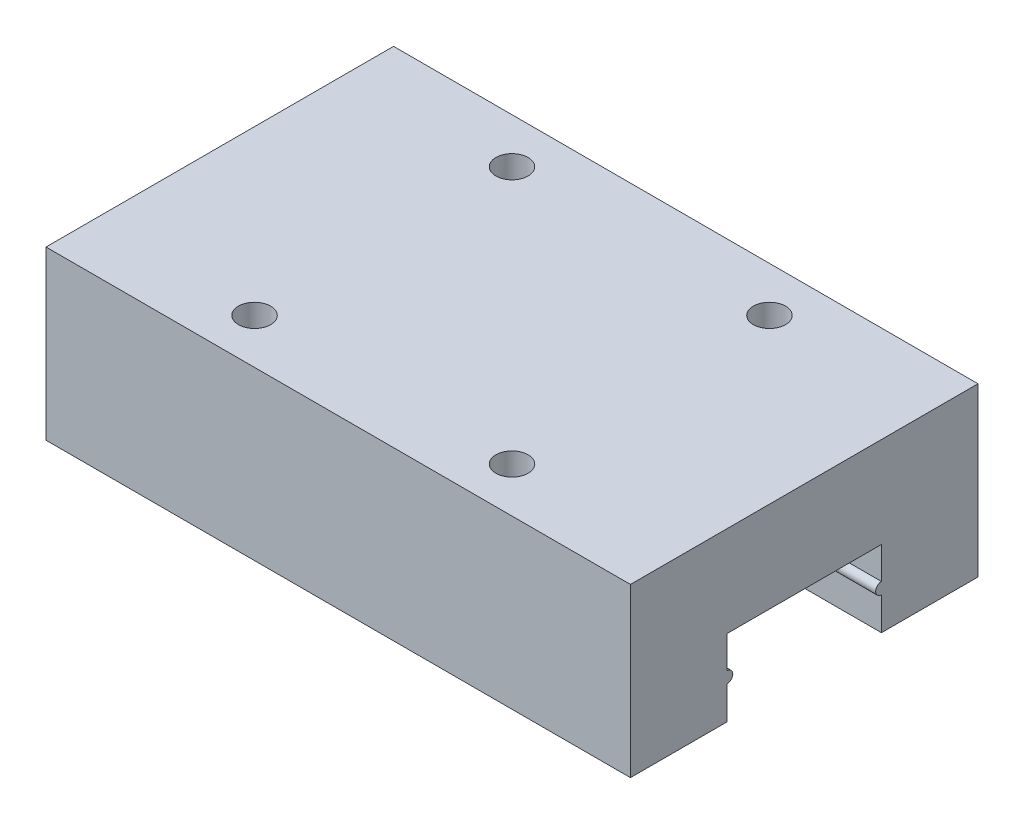
ISO-10303-21;
HEADER;
FILE_DESCRIPTION(('STEP AP214'),'2;1');
FILE_NAME('part.step','',(''),(''),'','','');
FILE_SCHEMA(('AUTOMOTIVE_DESIGN { 1 0 10303 214 1 1 1 1 }'));
ENDSEC;
DATA;
#1=APPLICATION_CONTEXT('core data for automotive mechanical design processes');
#2=APPLICATION_PROTOCOL_DEFINITION('international standard','automotive_design',2000,#1);
#3=PRODUCT_CONTEXT('',#1,'mechanical');
#4=PRODUCT('Part','Part','',(#3));
#5=PRODUCT_RELATED_PRODUCT_CATEGORY('part','',(#4));
#6=PRODUCT_DEFINITION_FORMATION('','',#4);
#7=PRODUCT_DEFINITION_CONTEXT('part definition',#1,'design');
#8=PRODUCT_DEFINITION('design','',#6,#7);
#9=PRODUCT_DEFINITION_SHAPE('','',#8);
#10=(LENGTH_UNIT() NAMED_UNIT(*) SI_UNIT(.MILLI.,.METRE.));
#11=(NAMED_UNIT(*) PLANE_ANGLE_UNIT() SI_UNIT($,.RADIAN.));
#12=(NAMED_UNIT(*) SI_UNIT($,.STERADIAN.) SOLID_ANGLE_UNIT());
#13=UNCERTAINTY_MEASURE_WITH_UNIT(LENGTH_MEASURE(1.E-05),#10,'distance_accuracy_value','');
#14=(GEOMETRIC_REPRESENTATION_CONTEXT(3) GLOBAL_UNCERTAINTY_ASSIGNED_CONTEXT((#13)) GLOBAL_UNIT_ASSIGNED_CONTEXT((#10,
#11,#12)) REPRESENTATION_CONTEXT('',''));
#15=CARTESIAN_POINT('',(0.,0.,0.));
#16=DIRECTION('',(0.,0.,1.));
#17=DIRECTION('',(1.,0.,0.));
#18=AXIS2_PLACEMENT_3D('',#15,#16,#17);
#19=CARTESIAN_POINT('',(32.7,13.,-3.5));
#20=DIRECTION('',(0.,1.,0.));
#21=DIRECTION('',(0.,0.,1.));
#22=AXIS2_PLACEMENT_3D('',#19,#20,#21);
#23=CYLINDRICAL_SURFACE('',#22,1.25);
#24=CARTESIAN_POINT('',(32.7,9.5,-3.5));
#25=DIRECTION('',(0.,1.,0.));
#26=DIRECTION('',(0.,0.,1.));
#27=AXIS2_PLACEMENT_3D('',#24,#25,#26);
#28=CIRCLE('',#27,1.25);
#29=CARTESIAN_POINT('',(32.7,9.5,-2.25));
#30=VERTEX_POINT('',#29);
#31=EDGE_CURVE('E13',#30,#30,#28,.T.);
#32=ORIENTED_EDGE('',*,*,#31,.F.);
#33=EDGE_LOOP('',(#32));
#34=FACE_BOUND('',#33,.T.);
#35=CARTESIAN_POINT('',(32.7,13.,-3.5));
#36=DIRECTION('',(0.,1.,0.));
#37=DIRECTION('',(0.,0.,1.));
#38=AXIS2_PLACEMENT_3D('',#35,#36,#37);
#39=CIRCLE('',#38,1.25);
#40=CARTESIAN_POINT('',(32.7,13.,-2.25));
#41=VERTEX_POINT('',#40);
#42=EDGE_CURVE('E70',#41,#41,#39,.T.);
#43=ORIENTED_EDGE('',*,*,#42,.T.);
#44=EDGE_LOOP('',(#43));
#45=FACE_BOUND('',#44,.T.);
#46=ADVANCED_FACE('F62',(#34,#45),#23,.F.);
#47=CARTESIAN_POINT('',(32.7,9.5,-3.5));
#48=DIRECTION('',(0.,1.,0.));
#49=DIRECTION('',(0.,0.,1.));
#50=AXIS2_PLACEMENT_3D('',#47,#48,#49);
#51=CONICAL_SURFACE('',#50,1.25,1.02974425867665);
#52=CARTESIAN_POINT('',(32.7,8.74892422621555,-3.5));
#53=VERTEX_POINT('',#52);
#54=VERTEX_LOOP('',#53);
#55=FACE_BOUND('',#54,.T.);
#56=ORIENTED_EDGE('',*,*,#31,.T.);
#57=EDGE_LOOP('',(#56));
#58=FACE_BOUND('',#57,.T.);
#59=ADVANCED_FACE('F332',(#55,#58),#51,.F.);
#60=CARTESIAN_POINT('',(12.7,13.,-3.5));
#61=DIRECTION('',(0.,1.,0.));
#62=DIRECTION('',(0.,0.,1.));
#63=AXIS2_PLACEMENT_3D('',#60,#61,#62);
#64=CYLINDRICAL_SURFACE('',#63,1.25);
#65=CARTESIAN_POINT('',(12.7,9.5,-3.5));
#66=DIRECTION('',(0.,1.,0.));
#67=DIRECTION('',(0.,0.,1.));
#68=AXIS2_PLACEMENT_3D('',#65,#66,#67);
#69=CIRCLE('',#68,1.25);
#70=CARTESIAN_POINT('',(12.7,9.5,-2.25));
#71=VERTEX_POINT('',#70);
#72=EDGE_CURVE('E303',#71,#71,#69,.T.);
#73=ORIENTED_EDGE('',*,*,#72,.F.);
#74=EDGE_LOOP('',(#73));
#75=FACE_BOUND('',#74,.T.);
#76=CARTESIAN_POINT('',(12.7,13.,-3.5));
#77=DIRECTION('',(0.,1.,0.));
#78=DIRECTION('',(0.,0.,1.));
#79=AXIS2_PLACEMENT_3D('',#76,#77,#78);
#80=CIRCLE('',#79,1.25);
#81=CARTESIAN_POINT('',(12.7,13.,-2.25));
#82=VERTEX_POINT('',#81);
#83=EDGE_CURVE('E299',#82,#82,#80,.T.);
#84=ORIENTED_EDGE('',*,*,#83,.T.);
#85=EDGE_LOOP('',(#84));
#86=FACE_BOUND('',#85,.T.);
#87=ADVANCED_FACE('F337',(#75,#86),#64,.F.);
#88=CARTESIAN_POINT('',(12.7,9.5,-3.5));
#89=DIRECTION('',(0.,1.,0.));
#90=DIRECTION('',(0.,0.,1.));
#91=AXIS2_PLACEMENT_3D('',#88,#89,#90);
#92=CONICAL_SURFACE('',#91,1.25,1.02974425867665);
#93=CARTESIAN_POINT('',(12.7,8.74892422621555,-3.5));
#94=VERTEX_POINT('',#93);
#95=VERTEX_LOOP('',#94);
#96=FACE_BOUND('',#95,.T.);
#97=ORIENTED_EDGE('',*,*,#72,.T.);
#98=EDGE_LOOP('',(#97));
#99=FACE_BOUND('',#98,.T.);
#100=ADVANCED_FACE('F343',(#96,#99),#92,.F.);
#101=CARTESIAN_POINT('',(45.4,0.,-19.5));
#102=DIRECTION('',(0.,0.,-1.));
#103=DIRECTION('',(-1.,0.,0.));
#104=AXIS2_PLACEMENT_3D('',#101,#102,#103);
#105=PLANE('',#104);
#106=DIRECTION('',(0.,-1.,0.));
#107=VECTOR('',#106,1.);
#108=CARTESIAN_POINT('',(0.,0.,-19.5));
#109=LINE('',#108,#107);
#110=CARTESIAN_POINT('',(0.,5.94145413786868,-19.5));
#111=VERTEX_POINT('',#110);
#112=CARTESIAN_POINT('',(0.,3.45,-19.5));
#113=VERTEX_POINT('',#112);
#114=EDGE_CURVE('E182',#111,#113,#109,.T.);
#115=ORIENTED_EDGE('',*,*,#114,.T.);
#116=DIRECTION('',(-1.,0.,0.));
#117=VECTOR('',#116,1.);
#118=CARTESIAN_POINT('',(45.4,3.45,-19.5));
#119=LINE('',#118,#117);
#120=CARTESIAN_POINT('',(45.4,3.45,-19.5));
#121=VERTEX_POINT('',#120);
#122=EDGE_CURVE('E295',#121,#113,#119,.T.);
#123=ORIENTED_EDGE('',*,*,#122,.F.);
#124=DIRECTION('',(0.,-1.,0.));
#125=VECTOR('',#124,1.);
#126=CARTESIAN_POINT('',(45.4,0.,-19.5));
#127=LINE('',#126,#125);
#128=CARTESIAN_POINT('',(45.4,5.94145413786868,-19.5));
#129=VERTEX_POINT('',#128);
#130=EDGE_CURVE('E183',#129,#121,#127,.T.);
#131=ORIENTED_EDGE('',*,*,#130,.F.);
#132=DIRECTION('',(-1.,0.,0.));
#133=VECTOR('',#132,1.);
#134=CARTESIAN_POINT('',(45.4,5.94145413786868,-19.5));
#135=LINE('',#134,#133);
#136=EDGE_CURVE('E220',#129,#111,#135,.T.);
#137=ORIENTED_EDGE('',*,*,#136,.T.);
#138=EDGE_LOOP('',(#115,#123,#131,#137));
#139=FACE_BOUND('',#138,.T.);
#140=ADVANCED_FACE('F349',(#139),#105,.F.);
#141=CARTESIAN_POINT('',(45.4,3.,-19.5));
#142=DIRECTION('',(-1.,0.,0.));
#143=DIRECTION('',(0.,0.,1.));
#144=AXIS2_PLACEMENT_3D('',#141,#142,#143);
#145=CYLINDRICAL_SURFACE('',#144,0.45);
#146=CARTESIAN_POINT('',(0.,3.,-19.5));
#147=DIRECTION('',(1.,0.,0.));
#148=DIRECTION('',(0.,0.,-1.));
#149=AXIS2_PLACEMENT_3D('',#146,#147,#148);
#150=CIRCLE('',#149,0.45);
#151=CARTESIAN_POINT('',(0.,2.55,-19.5));
#152=VERTEX_POINT('',#151);
#153=EDGE_CURVE('E224',#113,#152,#150,.T.);
#154=ORIENTED_EDGE('',*,*,#153,.T.);
#155=DIRECTION('',(-1.,0.,0.));
#156=VECTOR('',#155,1.);
#157=CARTESIAN_POINT('',(45.4,2.55,-19.5));
#158=LINE('',#157,#156);
#159=CARTESIAN_POINT('',(45.4,2.55,-19.5));
#160=VERTEX_POINT('',#159);
#161=EDGE_CURVE('E291',#160,#152,#158,.T.);
#162=ORIENTED_EDGE('',*,*,#161,.F.);
#163=CARTESIAN_POINT('',(45.4,3.,-19.5));
#164=DIRECTION('',(1.,0.,0.));
#165=DIRECTION('',(0.,0.,-1.));
#166=AXIS2_PLACEMENT_3D('',#163,#164,#165);
#167=CIRCLE('',#166,0.45);
#168=EDGE_CURVE('E187',#121,#160,#167,.T.);
#169=ORIENTED_EDGE('',*,*,#168,.F.);
#170=ORIENTED_EDGE('',*,*,#122,.T.);
#171=EDGE_LOOP('',(#154,#162,#169,#170));
#172=FACE_BOUND('',#171,.T.);
#173=ADVANCED_FACE('F350',(#172),#145,.T.);
#174=CARTESIAN_POINT('',(0.,0.,-19.5));
#175=VERTEX_POINT('',#174);
#176=EDGE_CURVE('E225',#152,#175,#109,.T.);
#177=ORIENTED_EDGE('',*,*,#176,.T.);
#178=DIRECTION('',(-1.,0.,0.));
#179=VECTOR('',#178,1.);
#180=CARTESIAN_POINT('',(45.4,0.,-19.5));
#181=LINE('',#180,#179);
#182=CARTESIAN_POINT('',(45.4,0.,-19.5));
#183=VERTEX_POINT('',#182);
#184=EDGE_CURVE('E287',#183,#175,#181,.T.);
#185=ORIENTED_EDGE('',*,*,#184,.F.);
#186=EDGE_CURVE('E189',#160,#183,#127,.T.);
#187=ORIENTED_EDGE('',*,*,#186,.F.);
#188=ORIENTED_EDGE('',*,*,#161,.T.);
#189=EDGE_LOOP('',(#177,#185,#187,#188));
#190=FACE_BOUND('',#189,.T.);
#191=ADVANCED_FACE('F353',(#190),#105,.F.);
#192=CARTESIAN_POINT('',(45.4,0.,0.));
#193=DIRECTION('',(0.,1.,0.));
#194=DIRECTION('',(0.,0.,1.));
#195=AXIS2_PLACEMENT_3D('',#192,#193,#194);
#196=PLANE('',#195);
#197=DIRECTION('',(0.,0.,-1.));
#198=VECTOR('',#197,1.);
#199=CARTESIAN_POINT('',(0.,0.,0.));
#200=LINE('',#199,#198);
#201=CARTESIAN_POINT('',(0.,0.,-27.));
#202=VERTEX_POINT('',#201);
#203=EDGE_CURVE('E228',#175,#202,#200,.T.);
#204=ORIENTED_EDGE('',*,*,#203,.T.);
#205=DIRECTION('',(-1.,0.,0.));
#206=VECTOR('',#205,1.);
#207=CARTESIAN_POINT('',(45.4,0.,-27.));
#208=LINE('',#207,#206);
#209=CARTESIAN_POINT('',(45.4,0.,-27.));
#210=VERTEX_POINT('',#209);
#211=EDGE_CURVE('E283',#210,#202,#208,.T.);
#212=ORIENTED_EDGE('',*,*,#211,.F.);
#213=DIRECTION('',(0.,0.,-1.));
#214=VECTOR('',#213,1.);
#215=CARTESIAN_POINT('',(45.4,0.,0.));
#216=LINE('',#215,#214);
#217=EDGE_CURVE('E192',#183,#210,#216,.T.);
#218=ORIENTED_EDGE('',*,*,#217,.F.);
#219=ORIENTED_EDGE('',*,*,#184,.T.);
#220=EDGE_LOOP('',(#204,#212,#218,#219));
#221=FACE_BOUND('',#220,.T.);
#222=ADVANCED_FACE('F326',(#221),#196,.F.);
#223=CARTESIAN_POINT('',(45.4,0.,-27.));
#224=DIRECTION('',(0.,0.,1.));
#225=DIRECTION('',(1.,0.,0.));
#226=AXIS2_PLACEMENT_3D('',#223,#224,#225);
#227=PLANE('',#226);
#228=DIRECTION('',(0.,1.,0.));
#229=VECTOR('',#228,1.);
#230=CARTESIAN_POINT('',(0.,0.,-27.));
#231=LINE('',#230,#229);
#232=CARTESIAN_POINT('',(0.,13.,-27.));
#233=VERTEX_POINT('',#232);
#234=EDGE_CURVE('E231',#202,#233,#231,.T.);
#235=ORIENTED_EDGE('',*,*,#234,.T.);
#236=DIRECTION('',(-1.,0.,0.));
#237=VECTOR('',#236,1.);
#238=CARTESIAN_POINT('',(45.4,13.,-27.));
#239=LINE('',#238,#237);
#240=CARTESIAN_POINT('',(45.4,13.,-27.));
#241=VERTEX_POINT('',#240);
#242=EDGE_CURVE('E280',#241,#233,#239,.T.);
#243=ORIENTED_EDGE('',*,*,#242,.F.);
#244=DIRECTION('',(0.,1.,0.));
#245=VECTOR('',#244,1.);
#246=CARTESIAN_POINT('',(45.4,0.,-27.));
#247=LINE('',#246,#245);
#248=EDGE_CURVE('E195',#210,#241,#247,.T.);
#249=ORIENTED_EDGE('',*,*,#248,.F.);
#250=ORIENTED_EDGE('',*,*,#211,.T.);
#251=EDGE_LOOP('',(#235,#243,#249,#250));
#252=FACE_BOUND('',#251,.T.);
#253=ADVANCED_FACE('F316',(#252),#227,.F.);
#254=CARTESIAN_POINT('',(45.4,13.,0.));
#255=DIRECTION('',(0.,1.,0.));
#256=DIRECTION('',(0.,0.,1.));
#257=AXIS2_PLACEMENT_3D('',#254,#255,#256);
#258=PLANE('',#257);
#259=CARTESIAN_POINT('',(32.7,13.,-23.5));
#260=DIRECTION('',(0.,1.,0.));
#261=DIRECTION('',(0.,0.,1.));
#262=AXIS2_PLACEMENT_3D('',#259,#260,#261);
#263=CIRCLE('',#262,1.25);
#264=CARTESIAN_POINT('',(32.7,13.,-22.25));
#265=VERTEX_POINT('',#264);
#266=EDGE_CURVE('E167',#265,#265,#263,.T.);
#267=ORIENTED_EDGE('',*,*,#266,.F.);
#268=EDGE_LOOP('',(#267));
#269=FACE_BOUND('',#268,.T.);
#270=CARTESIAN_POINT('',(12.7,13.,-23.5));
#271=DIRECTION('',(0.,1.,0.));
#272=DIRECTION('',(0.,0.,1.));
#273=AXIS2_PLACEMENT_3D('',#270,#271,#272);
#274=CIRCLE('',#273,1.25);
#275=CARTESIAN_POINT('',(12.7,13.,-22.25));
#276=VERTEX_POINT('',#275);
#277=EDGE_CURVE('E166',#276,#276,#274,.T.);
#278=ORIENTED_EDGE('',*,*,#277,.F.);
#279=EDGE_LOOP('',(#278));
#280=FACE_BOUND('',#279,.T.);
#281=DIRECTION('',(0.,0.,-1.));
#282=VECTOR('',#281,1.);
#283=CARTESIAN_POINT('',(0.,13.,0.));
#284=LINE('',#283,#282);
#285=CARTESIAN_POINT('',(0.,13.,0.));
#286=VERTEX_POINT('',#285);
#287=EDGE_CURVE('E235',#286,#233,#284,.T.);
#288=ORIENTED_EDGE('',*,*,#287,.F.);
#289=DIRECTION('',(-1.,0.,0.));
#290=VECTOR('',#289,1.);
#291=CARTESIAN_POINT('',(45.4,13.,0.));
#292=LINE('',#291,#290);
#293=CARTESIAN_POINT('',(45.4,13.,0.));
#294=VERTEX_POINT('',#293);
#295=EDGE_CURVE('E277',#294,#286,#292,.T.);
#296=ORIENTED_EDGE('',*,*,#295,.F.);
#297=DIRECTION('',(0.,0.,-1.));
#298=VECTOR('',#297,1.);
#299=CARTESIAN_POINT('',(45.4,13.,0.));
#300=LINE('',#299,#298);
#301=EDGE_CURVE('E198',#294,#241,#300,.T.);
#302=ORIENTED_EDGE('',*,*,#301,.T.);
#303=ORIENTED_EDGE('',*,*,#242,.T.);
#304=EDGE_LOOP('',(#288,#296,#302,#303));
#305=FACE_BOUND('',#304,.T.);
#306=ORIENTED_EDGE('',*,*,#83,.F.);
#307=EDGE_LOOP('',(#306));
#308=FACE_BOUND('',#307,.T.);
#309=ORIENTED_EDGE('',*,*,#42,.F.);
#310=EDGE_LOOP('',(#309));
#311=FACE_BOUND('',#310,.T.);
#312=ADVANCED_FACE('F313',(#269,#280,#305,#308,#311),#258,.T.);
#313=CARTESIAN_POINT('',(45.4,0.,0.));
#314=DIRECTION('',(0.,0.,1.));
#315=DIRECTION('',(1.,0.,0.));
#316=AXIS2_PLACEMENT_3D('',#313,#314,#315);
#317=PLANE('',#316);
#318=DIRECTION('',(0.,1.,0.));
#319=VECTOR('',#318,1.);
#320=CARTESIAN_POINT('',(0.,0.,0.));
#321=LINE('',#320,#319);
#322=CARTESIAN_POINT('',(0.,0.,0.));
#323=VERTEX_POINT('',#322);
#324=EDGE_CURVE('E239',#323,#286,#321,.T.);
#325=ORIENTED_EDGE('',*,*,#324,.F.);
#326=DIRECTION('',(-1.,0.,0.));
#327=VECTOR('',#326,1.);
#328=CARTESIAN_POINT('',(45.4,0.,0.));
#329=LINE('',#328,#327);
#330=CARTESIAN_POINT('',(45.4,0.,0.));
#331=VERTEX_POINT('',#330);
#332=EDGE_CURVE('E274',#331,#323,#329,.T.);
#333=ORIENTED_EDGE('',*,*,#332,.F.);
#334=DIRECTION('',(0.,1.,0.));
#335=VECTOR('',#334,1.);
#336=CARTESIAN_POINT('',(45.4,0.,0.));
#337=LINE('',#336,#335);
#338=EDGE_CURVE('E202',#331,#294,#337,.T.);
#339=ORIENTED_EDGE('',*,*,#338,.T.);
#340=ORIENTED_EDGE('',*,*,#295,.T.);
#341=EDGE_LOOP('',(#325,#333,#339,#340));
#342=FACE_BOUND('',#341,.T.);
#343=ADVANCED_FACE('F315',(#342),#317,.T.);
#344=CARTESIAN_POINT('',(45.4,0.,0.));
#345=DIRECTION('',(0.,1.,0.));
#346=DIRECTION('',(0.,0.,1.));
#347=AXIS2_PLACEMENT_3D('',#344,#345,#346);
#348=PLANE('',#347);
#349=DIRECTION('',(0.,0.,-1.));
#350=VECTOR('',#349,1.);
#351=CARTESIAN_POINT('',(0.,0.,0.));
#352=LINE('',#351,#350);
#353=CARTESIAN_POINT('',(0.,0.,-7.5));
#354=VERTEX_POINT('',#353);
#355=EDGE_CURVE('E243',#323,#354,#352,.T.);
#356=ORIENTED_EDGE('',*,*,#355,.T.);
#357=DIRECTION('',(-1.,0.,0.));
#358=VECTOR('',#357,1.);
#359=CARTESIAN_POINT('',(45.4,0.,-7.5));
#360=LINE('',#359,#358);
#361=CARTESIAN_POINT('',(45.4,0.,-7.5));
#362=VERTEX_POINT('',#361);
#363=EDGE_CURVE('E270',#362,#354,#360,.T.);
#364=ORIENTED_EDGE('',*,*,#363,.F.);
#365=DIRECTION('',(0.,0.,-1.));
#366=VECTOR('',#365,1.);
#367=CARTESIAN_POINT('',(45.4,0.,0.));
#368=LINE('',#367,#366);
#369=EDGE_CURVE('E206',#331,#362,#368,.T.);
#370=ORIENTED_EDGE('',*,*,#369,.F.);
#371=ORIENTED_EDGE('',*,*,#332,.T.);
#372=EDGE_LOOP('',(#356,#364,#370,#371));
#373=FACE_BOUND('',#372,.T.);
#374=ADVANCED_FACE('F323',(#373),#348,.F.);
#375=CARTESIAN_POINT('',(45.4,0.,-7.5));
#376=DIRECTION('',(0.,0.,1.));
#377=DIRECTION('',(1.,0.,0.));
#378=AXIS2_PLACEMENT_3D('',#375,#376,#377);
#379=PLANE('',#378);
#380=DIRECTION('',(0.,1.,0.));
#381=VECTOR('',#380,1.);
#382=CARTESIAN_POINT('',(0.,0.,-7.5));
#383=LINE('',#382,#381);
#384=CARTESIAN_POINT('',(0.,2.55,-7.5));
#385=VERTEX_POINT('',#384);
#386=EDGE_CURVE('E246',#354,#385,#383,.T.);
#387=ORIENTED_EDGE('',*,*,#386,.T.);
#388=DIRECTION('',(-1.,0.,0.));
#389=VECTOR('',#388,1.);
#390=CARTESIAN_POINT('',(45.4,2.55,-7.5));
#391=LINE('',#390,#389);
#392=CARTESIAN_POINT('',(45.4,2.55,-7.5));
#393=VERTEX_POINT('',#392);
#394=EDGE_CURVE('E267',#393,#385,#391,.T.);
#395=ORIENTED_EDGE('',*,*,#394,.F.);
#396=DIRECTION('',(0.,1.,0.));
#397=VECTOR('',#396,1.);
#398=CARTESIAN_POINT('',(45.4,0.,-7.5));
#399=LINE('',#398,#397);
#400=EDGE_CURVE('E209',#362,#393,#399,.T.);
#401=ORIENTED_EDGE('',*,*,#400,.F.);
#402=ORIENTED_EDGE('',*,*,#363,.T.);
#403=EDGE_LOOP('',(#387,#395,#401,#402));
#404=FACE_BOUND('',#403,.T.);
#405=ADVANCED_FACE('F389',(#404),#379,.F.);
#406=CARTESIAN_POINT('',(45.4,3.,-7.5));
#407=DIRECTION('',(-1.,0.,0.));
#408=DIRECTION('',(0.,0.,1.));
#409=AXIS2_PLACEMENT_3D('',#406,#407,#408);
#410=CYLINDRICAL_SURFACE('',#409,0.45);
#411=CARTESIAN_POINT('',(0.,3.,-7.5));
#412=DIRECTION('',(1.,0.,0.));
#413=DIRECTION('',(0.,0.,-1.));
#414=AXIS2_PLACEMENT_3D('',#411,#412,#413);
#415=CIRCLE('',#414,0.45);
#416=CARTESIAN_POINT('',(0.,3.45,-7.5));
#417=VERTEX_POINT('',#416);
#418=EDGE_CURVE('E250',#417,#385,#415,.F.);
#419=ORIENTED_EDGE('',*,*,#418,.F.);
#420=DIRECTION('',(-1.,0.,0.));
#421=VECTOR('',#420,1.);
#422=CARTESIAN_POINT('',(45.4,3.45,-7.5));
#423=LINE('',#422,#421);
#424=CARTESIAN_POINT('',(45.4,3.45,-7.5));
#425=VERTEX_POINT('',#424);
#426=EDGE_CURVE('E264',#425,#417,#423,.T.);
#427=ORIENTED_EDGE('',*,*,#426,.F.);
#428=CARTESIAN_POINT('',(45.4,3.,-7.5));
#429=DIRECTION('',(1.,0.,0.));
#430=DIRECTION('',(0.,0.,-1.));
#431=AXIS2_PLACEMENT_3D('',#428,#429,#430);
#432=CIRCLE('',#431,0.45);
#433=EDGE_CURVE('E212',#425,#393,#432,.F.);
#434=ORIENTED_EDGE('',*,*,#433,.T.);
#435=ORIENTED_EDGE('',*,*,#394,.T.);
#436=EDGE_LOOP('',(#419,#427,#434,#435));
#437=FACE_BOUND('',#436,.T.);
#438=ADVANCED_FACE('F393',(#437),#410,.T.);
#439=CARTESIAN_POINT('',(0.,5.94145413786868,-7.5));
#440=VERTEX_POINT('',#439);
#441=EDGE_CURVE('E251',#417,#440,#383,.T.);
#442=ORIENTED_EDGE('',*,*,#441,.T.);
#443=DIRECTION('',(-1.,0.,0.));
#444=VECTOR('',#443,1.);
#445=CARTESIAN_POINT('',(45.4,5.94145413786868,-7.5));
#446=LINE('',#445,#444);
#447=CARTESIAN_POINT('',(45.4,5.94145413786868,-7.5));
#448=VERTEX_POINT('',#447);
#449=EDGE_CURVE('E260',#448,#440,#446,.T.);
#450=ORIENTED_EDGE('',*,*,#449,.F.);
#451=EDGE_CURVE('E213',#425,#448,#399,.T.);
#452=ORIENTED_EDGE('',*,*,#451,.F.);
#453=ORIENTED_EDGE('',*,*,#426,.T.);
#454=EDGE_LOOP('',(#442,#450,#452,#453));
#455=FACE_BOUND('',#454,.T.);
#456=ADVANCED_FACE('F398',(#455),#379,.F.);
#457=CARTESIAN_POINT('',(45.4,5.94145413786868,0.));
#458=DIRECTION('',(0.,1.,0.));
#459=DIRECTION('',(0.,0.,1.));
#460=AXIS2_PLACEMENT_3D('',#457,#458,#459);
#461=PLANE('',#460);
#462=DIRECTION('',(0.,0.,-1.));
#463=VECTOR('',#462,1.);
#464=CARTESIAN_POINT('',(0.,5.94145413786868,0.));
#465=LINE('',#464,#463);
#466=EDGE_CURVE('E188',#440,#111,#465,.T.);
#467=ORIENTED_EDGE('',*,*,#466,.T.);
#468=ORIENTED_EDGE('',*,*,#136,.F.);
#469=DIRECTION('',(0.,0.,-1.));
#470=VECTOR('',#469,1.);
#471=CARTESIAN_POINT('',(45.4,5.94145413786868,0.));
#472=LINE('',#471,#470);
#473=EDGE_CURVE('E217',#448,#129,#472,.T.);
#474=ORIENTED_EDGE('',*,*,#473,.F.);
#475=ORIENTED_EDGE('',*,*,#449,.T.);
#476=EDGE_LOOP('',(#467,#468,#474,#475));
#477=FACE_BOUND('',#476,.T.);
#478=ADVANCED_FACE('F466',(#477),#461,.F.);
#479=CARTESIAN_POINT('',(45.4,0.,0.));
#480=DIRECTION('',(1.,0.,0.));
#481=DIRECTION('',(0.,0.,-1.));
#482=AXIS2_PLACEMENT_3D('',#479,#480,#481);
#483=PLANE('',#482);
#484=ORIENTED_EDGE('',*,*,#130,.T.);
#485=ORIENTED_EDGE('',*,*,#168,.T.);
#486=ORIENTED_EDGE('',*,*,#186,.T.);
#487=ORIENTED_EDGE('',*,*,#217,.T.);
#488=ORIENTED_EDGE('',*,*,#248,.T.);
#489=ORIENTED_EDGE('',*,*,#301,.F.);
#490=ORIENTED_EDGE('',*,*,#338,.F.);
#491=ORIENTED_EDGE('',*,*,#369,.T.);
#492=ORIENTED_EDGE('',*,*,#400,.T.);
#493=ORIENTED_EDGE('',*,*,#433,.F.);
#494=ORIENTED_EDGE('',*,*,#451,.T.);
#495=ORIENTED_EDGE('',*,*,#473,.T.);
#496=EDGE_LOOP('',(#484,#485,#486,#487,#488,#489,#490,#491,#492,#493,#494,#495));
#497=FACE_BOUND('',#496,.T.);
#498=ADVANCED_FACE('F381',(#497),#483,.T.);
#499=CARTESIAN_POINT('',(0.,0.,0.));
#500=DIRECTION('',(1.,0.,0.));
#501=DIRECTION('',(0.,0.,-1.));
#502=AXIS2_PLACEMENT_3D('',#499,#500,#501);
#503=PLANE('',#502);
#504=ORIENTED_EDGE('',*,*,#114,.F.);
#505=ORIENTED_EDGE('',*,*,#466,.F.);
#506=ORIENTED_EDGE('',*,*,#441,.F.);
#507=ORIENTED_EDGE('',*,*,#418,.T.);
#508=ORIENTED_EDGE('',*,*,#386,.F.);
#509=ORIENTED_EDGE('',*,*,#355,.F.);
#510=ORIENTED_EDGE('',*,*,#324,.T.);
#511=ORIENTED_EDGE('',*,*,#287,.T.);
#512=ORIENTED_EDGE('',*,*,#234,.F.);
#513=ORIENTED_EDGE('',*,*,#203,.F.);
#514=ORIENTED_EDGE('',*,*,#176,.F.);
#515=ORIENTED_EDGE('',*,*,#153,.F.);
#516=EDGE_LOOP('',(#504,#505,#506,#507,#508,#509,#510,#511,#512,#513,#514,#515));
#517=FACE_BOUND('',#516,.T.);
#518=ADVANCED_FACE('F372',(#517),#503,.F.);
#519=CARTESIAN_POINT('',(12.7,9.5,-23.5));
#520=DIRECTION('',(0.,1.,0.));
#521=DIRECTION('',(0.,0.,1.));
#522=AXIS2_PLACEMENT_3D('',#519,#520,#521);
#523=CONICAL_SURFACE('',#522,1.25,1.02974425867665);
#524=CARTESIAN_POINT('',(12.7,8.74892422621555,-23.5));
#525=VERTEX_POINT('',#524);
#526=VERTEX_LOOP('',#525);
#527=FACE_BOUND('',#526,.T.);
#528=CARTESIAN_POINT('',(12.7,9.5,-23.5));
#529=DIRECTION('',(0.,1.,0.));
#530=DIRECTION('',(0.,0.,1.));
#531=AXIS2_PLACEMENT_3D('',#528,#529,#530);
#532=CIRCLE('',#531,1.25);
#533=CARTESIAN_POINT('',(12.7,9.5,-22.25));
#534=VERTEX_POINT('',#533);
#535=EDGE_CURVE('E174',#534,#534,#532,.T.);
#536=ORIENTED_EDGE('',*,*,#535,.T.);
#537=EDGE_LOOP('',(#536));
#538=FACE_BOUND('',#537,.T.);
#539=ADVANCED_FACE('F517',(#527,#538),#523,.F.);
#540=CARTESIAN_POINT('',(12.7,13.,-23.5));
#541=DIRECTION('',(0.,1.,0.));
#542=DIRECTION('',(0.,0.,1.));
#543=AXIS2_PLACEMENT_3D('',#540,#541,#542);
#544=CYLINDRICAL_SURFACE('',#543,1.25);
#545=ORIENTED_EDGE('',*,*,#535,.F.);
#546=EDGE_LOOP('',(#545));
#547=FACE_BOUND('',#546,.T.);
#548=ORIENTED_EDGE('',*,*,#277,.T.);
#549=EDGE_LOOP('',(#548));
#550=FACE_BOUND('',#549,.T.);
#551=ADVANCED_FACE('F159',(#547,#550),#544,.F.);
#552=CARTESIAN_POINT('',(32.7,9.5,-23.5));
#553=DIRECTION('',(0.,1.,0.));
#554=DIRECTION('',(0.,0.,1.));
#555=AXIS2_PLACEMENT_3D('',#552,#553,#554);
#556=CONICAL_SURFACE('',#555,1.25,1.02974425867665);
#557=CARTESIAN_POINT('',(32.7,8.74892422621555,-23.5));
#558=VERTEX_POINT('',#557);
#559=VERTEX_LOOP('',#558);
#560=FACE_BOUND('',#559,.T.);
#561=CARTESIAN_POINT('',(32.7,9.5,-23.5));
#562=DIRECTION('',(0.,1.,0.));
#563=DIRECTION('',(0.,0.,1.));
#564=AXIS2_PLACEMENT_3D('',#561,#562,#563);
#565=CIRCLE('',#564,1.25);
#566=CARTESIAN_POINT('',(32.7,9.5,-22.25));
#567=VERTEX_POINT('',#566);
#568=EDGE_CURVE('E163',#567,#567,#565,.T.);
#569=ORIENTED_EDGE('',*,*,#568,.T.);
#570=EDGE_LOOP('',(#569));
#571=FACE_BOUND('',#570,.T.);
#572=ADVANCED_FACE('F155',(#560,#571),#556,.F.);
#573=CARTESIAN_POINT('',(32.7,13.,-23.5));
#574=DIRECTION('',(0.,1.,0.));
#575=DIRECTION('',(0.,0.,1.));
#576=AXIS2_PLACEMENT_3D('',#573,#574,#575);
#577=CYLINDRICAL_SURFACE('',#576,1.25);
#578=ORIENTED_EDGE('',*,*,#568,.F.);
#579=EDGE_LOOP('',(#578));
#580=FACE_BOUND('',#579,.T.);
#581=ORIENTED_EDGE('',*,*,#266,.T.);
#582=EDGE_LOOP('',(#581));
#583=FACE_BOUND('',#582,.T.);
#584=ADVANCED_FACE('F158',(#580,#583),#577,.F.);
#585=CLOSED_SHELL('',(#46,#59,#87,#100,#140,#173,#191,#222,#253,#312,#343,#374,#405,#438,#456,
#478,#498,#518,#539,#551,#572,#584));
#586=MANIFOLD_SOLID_BREP('B2',#585);
#587=ADVANCED_BREP_SHAPE_REPRESENTATION('',(#18,#586),#14);
#588=SHAPE_DEFINITION_REPRESENTATION(#9,#587);
ENDSEC;
END-ISO-10303-21;
